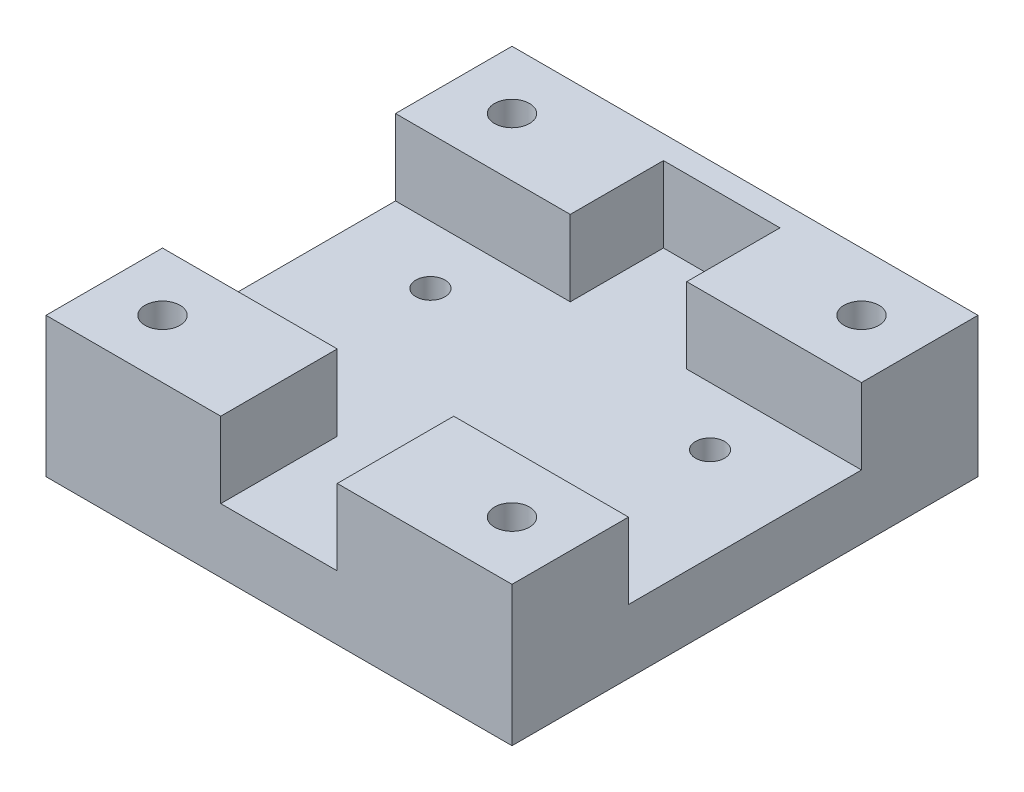
ISO-10303-21;
HEADER;
FILE_DESCRIPTION(('STEP AP214'),'2;1');
FILE_NAME('part.step','',(''),(''),'','','');
FILE_SCHEMA(('AUTOMOTIVE_DESIGN { 1 0 10303 214 1 1 1 1 }'));
ENDSEC;
DATA;
#1=APPLICATION_CONTEXT('core data for automotive mechanical design processes');
#2=APPLICATION_PROTOCOL_DEFINITION('international standard','automotive_design',2000,#1);
#3=PRODUCT_CONTEXT('',#1,'mechanical');
#4=PRODUCT('Part','Part','',(#3));
#5=PRODUCT_RELATED_PRODUCT_CATEGORY('part','',(#4));
#6=PRODUCT_DEFINITION_FORMATION('','',#4);
#7=PRODUCT_DEFINITION_CONTEXT('part definition',#1,'design');
#8=PRODUCT_DEFINITION('design','',#6,#7);
#9=PRODUCT_DEFINITION_SHAPE('','',#8);
#10=(LENGTH_UNIT() NAMED_UNIT(*) SI_UNIT(.MILLI.,.METRE.));
#11=(NAMED_UNIT(*) PLANE_ANGLE_UNIT() SI_UNIT($,.RADIAN.));
#12=(NAMED_UNIT(*) SI_UNIT($,.STERADIAN.) SOLID_ANGLE_UNIT());
#13=UNCERTAINTY_MEASURE_WITH_UNIT(LENGTH_MEASURE(1.E-05),#10,'distance_accuracy_value','');
#14=(GEOMETRIC_REPRESENTATION_CONTEXT(3) GLOBAL_UNCERTAINTY_ASSIGNED_CONTEXT((#13)) GLOBAL_UNIT_ASSIGNED_CONTEXT((#10,
#11,#12)) REPRESENTATION_CONTEXT('',''));
#15=CARTESIAN_POINT('',(0.,0.,0.));
#16=DIRECTION('',(0.,0.,1.));
#17=DIRECTION('',(1.,0.,0.));
#18=AXIS2_PLACEMENT_3D('',#15,#16,#17);
#19=CARTESIAN_POINT('',(5.,0.,40.));
#20=DIRECTION('',(1.,0.,0.));
#21=DIRECTION('',(0.,1.,0.));
#22=AXIS2_PLACEMENT_3D('',#19,#20,#21);
#23=PLANE('',#22);
#24=DIRECTION('',(0.,0.,-1.));
#25=VECTOR('',#24,1.);
#26=CARTESIAN_POINT('',(5.,0.,40.));
#27=LINE('',#26,#25);
#28=CARTESIAN_POINT('',(5.,0.,40.));
#29=VERTEX_POINT('',#28);
#30=CARTESIAN_POINT('',(5.00000000000001,0.,30.));
#31=VERTEX_POINT('',#30);
#32=EDGE_CURVE('E262',#29,#31,#27,.T.);
#33=ORIENTED_EDGE('',*,*,#32,.T.);
#34=DIRECTION('',(0.,1.,0.));
#35=VECTOR('',#34,1.);
#36=CARTESIAN_POINT('',(5.00000000000001,-6.5,30.));
#37=LINE('',#36,#35);
#38=CARTESIAN_POINT('',(5.00000000000001,-6.5,30.));
#39=VERTEX_POINT('',#38);
#40=EDGE_CURVE('E174',#39,#31,#37,.T.);
#41=ORIENTED_EDGE('',*,*,#40,.F.);
#42=DIRECTION('',(0.,0.,-1.));
#43=VECTOR('',#42,1.);
#44=CARTESIAN_POINT('',(5.,-6.5,40.));
#45=LINE('',#44,#43);
#46=CARTESIAN_POINT('',(5.,-6.5,40.));
#47=VERTEX_POINT('',#46);
#48=EDGE_CURVE('E285',#47,#39,#45,.T.);
#49=ORIENTED_EDGE('',*,*,#48,.F.);
#50=DIRECTION('',(0.,-1.,0.));
#51=VECTOR('',#50,1.);
#52=CARTESIAN_POINT('',(5.,0.,40.));
#53=LINE('',#52,#51);
#54=EDGE_CURVE('E234',#29,#47,#53,.T.);
#55=ORIENTED_EDGE('',*,*,#54,.F.);
#56=EDGE_LOOP('',(#33,#41,#49,#55));
#57=FACE_BOUND('',#56,.T.);
#58=ADVANCED_FACE('F33',(#57),#23,.F.);
#59=CARTESIAN_POINT('',(5.,0.,40.));
#60=DIRECTION('',(0.,-1.,0.));
#61=DIRECTION('',(0.,0.,-1.));
#62=AXIS2_PLACEMENT_3D('',#59,#60,#61);
#63=PLANE('',#62);
#64=CARTESIAN_POINT('',(15.,0.,35.));
#65=DIRECTION('',(0.,1.,0.));
#66=DIRECTION('',(-1.,0.,0.));
#67=AXIS2_PLACEMENT_3D('',#64,#65,#66);
#68=CIRCLE('',#67,1.5);
#69=CARTESIAN_POINT('',(13.5,0.,35.));
#70=VERTEX_POINT('',#69);
#71=EDGE_CURVE('E215',#70,#70,#68,.T.);
#72=ORIENTED_EDGE('',*,*,#71,.F.);
#73=EDGE_LOOP('',(#72));
#74=FACE_BOUND('',#73,.T.);
#75=DIRECTION('',(0.,0.,-1.));
#76=VECTOR('',#75,1.);
#77=CARTESIAN_POINT('',(20.,0.,40.));
#78=LINE('',#77,#76);
#79=CARTESIAN_POINT('',(20.,0.,40.));
#80=VERTEX_POINT('',#79);
#81=CARTESIAN_POINT('',(20.,0.,30.));
#82=VERTEX_POINT('',#81);
#83=EDGE_CURVE('E265',#80,#82,#78,.T.);
#84=ORIENTED_EDGE('',*,*,#83,.T.);
#85=DIRECTION('',(1.,0.,0.));
#86=VECTOR('',#85,1.);
#87=CARTESIAN_POINT('',(20.,0.,30.));
#88=LINE('',#87,#86);
#89=EDGE_CURVE('E167',#31,#82,#88,.T.);
#90=ORIENTED_EDGE('',*,*,#89,.F.);
#91=ORIENTED_EDGE('',*,*,#32,.F.);
#92=DIRECTION('',(-1.,0.,0.));
#93=VECTOR('',#92,1.);
#94=CARTESIAN_POINT('',(5.,0.,40.));
#95=LINE('',#94,#93);
#96=EDGE_CURVE('E250',#80,#29,#95,.T.);
#97=ORIENTED_EDGE('',*,*,#96,.F.);
#98=EDGE_LOOP('',(#84,#90,#91,#97));
#99=FACE_BOUND('',#98,.T.);
#100=ADVANCED_FACE('F329',(#74,#99),#63,.F.);
#101=CARTESIAN_POINT('',(12.,-12.001,25.));
#102=DIRECTION('',(0.,1.,0.));
#103=DIRECTION('',(-1.,0.,0.));
#104=AXIS2_PLACEMENT_3D('',#101,#102,#103);
#105=CYLINDRICAL_SURFACE('',#104,1.25);
#106=CARTESIAN_POINT('',(12.,-10.,25.));
#107=DIRECTION('',(0.,1.,0.));
#108=DIRECTION('',(-1.,0.,0.));
#109=AXIS2_PLACEMENT_3D('',#106,#107,#108);
#110=CIRCLE('',#109,1.25);
#111=CARTESIAN_POINT('',(10.75,-10.,25.));
#112=VERTEX_POINT('',#111);
#113=EDGE_CURVE('E41',#112,#112,#110,.F.);
#114=ORIENTED_EDGE('',*,*,#113,.T.);
#115=EDGE_LOOP('',(#114));
#116=FACE_BOUND('',#115,.T.);
#117=CARTESIAN_POINT('',(12.,-6.49999999999999,25.));
#118=DIRECTION('',(0.,1.,0.));
#119=DIRECTION('',(-1.,0.,0.));
#120=AXIS2_PLACEMENT_3D('',#117,#118,#119);
#121=CIRCLE('',#120,1.25);
#122=CARTESIAN_POINT('',(10.75,-6.49999999999999,25.));
#123=VERTEX_POINT('',#122);
#124=EDGE_CURVE('E179',#123,#123,#121,.F.);
#125=ORIENTED_EDGE('',*,*,#124,.F.);
#126=EDGE_LOOP('',(#125));
#127=FACE_BOUND('',#126,.T.);
#128=ADVANCED_FACE('F312',(#116,#127),#105,.F.);
#129=CARTESIAN_POINT('',(12.,-12.001,15.));
#130=DIRECTION('',(0.,1.,0.));
#131=DIRECTION('',(-1.,0.,0.));
#132=AXIS2_PLACEMENT_3D('',#129,#130,#131);
#133=CYLINDRICAL_SURFACE('',#132,1.25);
#134=CARTESIAN_POINT('',(12.,-10.,15.));
#135=DIRECTION('',(0.,1.,0.));
#136=DIRECTION('',(-1.,0.,0.));
#137=AXIS2_PLACEMENT_3D('',#134,#135,#136);
#138=CIRCLE('',#137,1.25);
#139=CARTESIAN_POINT('',(10.75,-10.,15.));
#140=VERTEX_POINT('',#139);
#141=EDGE_CURVE('E287',#140,#140,#138,.F.);
#142=ORIENTED_EDGE('',*,*,#141,.T.);
#143=EDGE_LOOP('',(#142));
#144=FACE_BOUND('',#143,.T.);
#145=CARTESIAN_POINT('',(12.,-6.49999999999999,15.));
#146=DIRECTION('',(0.,1.,0.));
#147=DIRECTION('',(-1.,0.,0.));
#148=AXIS2_PLACEMENT_3D('',#145,#146,#147);
#149=CIRCLE('',#148,1.25);
#150=CARTESIAN_POINT('',(10.75,-6.49999999999999,15.));
#151=VERTEX_POINT('',#150);
#152=EDGE_CURVE('E183',#151,#151,#149,.F.);
#153=ORIENTED_EDGE('',*,*,#152,.F.);
#154=EDGE_LOOP('',(#153));
#155=FACE_BOUND('',#154,.T.);
#156=ADVANCED_FACE('F348',(#144,#155),#133,.F.);
#157=CARTESIAN_POINT('',(-5.,-6.5,40.));
#158=DIRECTION('',(-1.,0.,0.));
#159=DIRECTION('',(0.,0.,1.));
#160=AXIS2_PLACEMENT_3D('',#157,#158,#159);
#161=PLANE('',#160);
#162=DIRECTION('',(0.,0.,-1.));
#163=VECTOR('',#162,1.);
#164=CARTESIAN_POINT('',(-5.,-6.5,40.));
#165=LINE('',#164,#163);
#166=CARTESIAN_POINT('',(-5.,-6.5,10.));
#167=VERTEX_POINT('',#166);
#168=CARTESIAN_POINT('',(-5.,-6.5,2.));
#169=VERTEX_POINT('',#168);
#170=EDGE_CURVE('E280',#167,#169,#165,.T.);
#171=ORIENTED_EDGE('',*,*,#170,.T.);
#172=DIRECTION('',(0.,1.,0.));
#173=VECTOR('',#172,1.);
#174=CARTESIAN_POINT('',(-5.,-6.5,2.));
#175=LINE('',#174,#173);
#176=CARTESIAN_POINT('',(-5.,0.,2.));
#177=VERTEX_POINT('',#176);
#178=EDGE_CURVE('E48',#169,#177,#175,.T.);
#179=ORIENTED_EDGE('',*,*,#178,.T.);
#180=DIRECTION('',(0.,0.,-1.));
#181=VECTOR('',#180,1.);
#182=CARTESIAN_POINT('',(-5.,0.,40.));
#183=LINE('',#182,#181);
#184=CARTESIAN_POINT('',(-5.,0.,10.));
#185=VERTEX_POINT('',#184);
#186=EDGE_CURVE('E276',#185,#177,#183,.T.);
#187=ORIENTED_EDGE('',*,*,#186,.F.);
#188=DIRECTION('',(0.,1.,0.));
#189=VECTOR('',#188,1.);
#190=CARTESIAN_POINT('',(-5.,-6.5,10.));
#191=LINE('',#190,#189);
#192=EDGE_CURVE('E196',#167,#185,#191,.T.);
#193=ORIENTED_EDGE('',*,*,#192,.F.);
#194=EDGE_LOOP('',(#171,#179,#187,#193));
#195=FACE_BOUND('',#194,.T.);
#196=ADVANCED_FACE('F342',(#195),#161,.F.);
#197=CARTESIAN_POINT('',(5.00000000000001,0.,10.));
#198=VERTEX_POINT('',#197);
#199=CARTESIAN_POINT('',(5.,0.,2.));
#200=VERTEX_POINT('',#199);
#201=EDGE_CURVE('E252',#198,#200,#27,.T.);
#202=ORIENTED_EDGE('',*,*,#201,.T.);
#203=DIRECTION('',(0.,-1.,0.));
#204=VECTOR('',#203,1.);
#205=CARTESIAN_POINT('',(5.,0.,2.));
#206=LINE('',#205,#204);
#207=CARTESIAN_POINT('',(5.,-6.5,2.));
#208=VERTEX_POINT('',#207);
#209=EDGE_CURVE('E56',#200,#208,#206,.T.);
#210=ORIENTED_EDGE('',*,*,#209,.T.);
#211=CARTESIAN_POINT('',(5.00000000000001,-6.5,10.));
#212=VERTEX_POINT('',#211);
#213=EDGE_CURVE('E284',#212,#208,#45,.T.);
#214=ORIENTED_EDGE('',*,*,#213,.F.);
#215=DIRECTION('',(0.,1.,0.));
#216=VECTOR('',#215,1.);
#217=CARTESIAN_POINT('',(5.00000000000001,-6.5,10.));
#218=LINE('',#217,#216);
#219=EDGE_CURVE('E155',#212,#198,#218,.T.);
#220=ORIENTED_EDGE('',*,*,#219,.T.);
#221=EDGE_LOOP('',(#202,#210,#214,#220));
#222=FACE_BOUND('',#221,.T.);
#223=ADVANCED_FACE('F332',(#222),#23,.F.);
#224=CARTESIAN_POINT('',(5.,-6.5,40.));
#225=DIRECTION('',(0.,-1.,0.));
#226=DIRECTION('',(1.,0.,0.));
#227=AXIS2_PLACEMENT_3D('',#224,#225,#226);
#228=PLANE('',#227);
#229=ORIENTED_EDGE('',*,*,#213,.T.);
#230=DIRECTION('',(-1.,0.,0.));
#231=VECTOR('',#230,1.);
#232=CARTESIAN_POINT('',(5.,-6.5,2.));
#233=LINE('',#232,#231);
#234=EDGE_CURVE('E358',#208,#169,#233,.T.);
#235=ORIENTED_EDGE('',*,*,#234,.T.);
#236=ORIENTED_EDGE('',*,*,#170,.F.);
#237=DIRECTION('',(-1.,0.,0.));
#238=VECTOR('',#237,1.);
#239=CARTESIAN_POINT('',(-20.,-6.50000000000001,10.));
#240=LINE('',#239,#238);
#241=CARTESIAN_POINT('',(-20.,-6.50000000000001,10.));
#242=VERTEX_POINT('',#241);
#243=EDGE_CURVE('E184',#167,#242,#240,.T.);
#244=ORIENTED_EDGE('',*,*,#243,.T.);
#245=DIRECTION('',(0.,0.,1.));
#246=VECTOR('',#245,1.);
#247=CARTESIAN_POINT('',(-20.,-6.50000000000001,30.));
#248=LINE('',#247,#246);
#249=CARTESIAN_POINT('',(-20.,-6.50000000000001,30.));
#250=VERTEX_POINT('',#249);
#251=EDGE_CURVE('E186',#242,#250,#248,.T.);
#252=ORIENTED_EDGE('',*,*,#251,.T.);
#253=DIRECTION('',(1.,0.,0.));
#254=VECTOR('',#253,1.);
#255=CARTESIAN_POINT('',(-20.,-6.50000000000001,30.));
#256=LINE('',#255,#254);
#257=CARTESIAN_POINT('',(-5.,-6.5,30.));
#258=VERTEX_POINT('',#257);
#259=EDGE_CURVE('E190',#250,#258,#256,.T.);
#260=ORIENTED_EDGE('',*,*,#259,.T.);
#261=CARTESIAN_POINT('',(-5.,-6.5,40.));
#262=VERTEX_POINT('',#261);
#263=EDGE_CURVE('E281',#262,#258,#165,.T.);
#264=ORIENTED_EDGE('',*,*,#263,.F.);
#265=DIRECTION('',(-1.,0.,0.));
#266=VECTOR('',#265,1.);
#267=CARTESIAN_POINT('',(5.,-6.5,40.));
#268=LINE('',#267,#266);
#269=EDGE_CURVE('E237',#47,#262,#268,.T.);
#270=ORIENTED_EDGE('',*,*,#269,.F.);
#271=ORIENTED_EDGE('',*,*,#48,.T.);
#272=DIRECTION('',(1.,0.,0.));
#273=VECTOR('',#272,1.);
#274=CARTESIAN_POINT('',(20.,-6.49999999999999,30.));
#275=LINE('',#274,#273);
#276=CARTESIAN_POINT('',(20.,-6.49999999999999,30.));
#277=VERTEX_POINT('',#276);
#278=EDGE_CURVE('E157',#39,#277,#275,.T.);
#279=ORIENTED_EDGE('',*,*,#278,.T.);
#280=DIRECTION('',(0.,0.,-1.));
#281=VECTOR('',#280,1.);
#282=CARTESIAN_POINT('',(20.,-6.49999999999999,30.));
#283=LINE('',#282,#281);
#284=CARTESIAN_POINT('',(20.,-6.49999999999999,10.));
#285=VERTEX_POINT('',#284);
#286=EDGE_CURVE('E158',#277,#285,#283,.T.);
#287=ORIENTED_EDGE('',*,*,#286,.T.);
#288=DIRECTION('',(-1.,0.,0.));
#289=VECTOR('',#288,1.);
#290=CARTESIAN_POINT('',(20.,-6.49999999999999,10.));
#291=LINE('',#290,#289);
#292=EDGE_CURVE('E148',#285,#212,#291,.T.);
#293=ORIENTED_EDGE('',*,*,#292,.T.);
#294=EDGE_LOOP('',(#229,#235,#236,#244,#252,#260,#264,#270,#271,#279,#287,#293));
#295=FACE_BOUND('',#294,.T.);
#296=CARTESIAN_POINT('',(-12.,-6.50000000000001,15.));
#297=DIRECTION('',(0.,-1.,0.));
#298=DIRECTION('',(1.,0.,0.));
#299=AXIS2_PLACEMENT_3D('',#296,#297,#298);
#300=CIRCLE('',#299,1.25);
#301=CARTESIAN_POINT('',(-10.75,-6.50000000000001,15.));
#302=VERTEX_POINT('',#301);
#303=EDGE_CURVE('E198',#302,#302,#300,.F.);
#304=ORIENTED_EDGE('',*,*,#303,.F.);
#305=EDGE_LOOP('',(#304));
#306=FACE_BOUND('',#305,.T.);
#307=CARTESIAN_POINT('',(-12.,-6.50000000000001,25.));
#308=DIRECTION('',(0.,-1.,0.));
#309=DIRECTION('',(1.,0.,0.));
#310=AXIS2_PLACEMENT_3D('',#307,#308,#309);
#311=CIRCLE('',#310,1.25);
#312=CARTESIAN_POINT('',(-10.75,-6.50000000000001,25.));
#313=VERTEX_POINT('',#312);
#314=EDGE_CURVE('E206',#313,#313,#311,.F.);
#315=ORIENTED_EDGE('',*,*,#314,.F.);
#316=EDGE_LOOP('',(#315));
#317=FACE_BOUND('',#316,.T.);
#318=ORIENTED_EDGE('',*,*,#152,.T.);
#319=EDGE_LOOP('',(#318));
#320=FACE_BOUND('',#319,.T.);
#321=ORIENTED_EDGE('',*,*,#124,.T.);
#322=EDGE_LOOP('',(#321));
#323=FACE_BOUND('',#322,.T.);
#324=ADVANCED_FACE('F162',(#295,#306,#317,#320,#323),#228,.F.);
#325=ORIENTED_EDGE('',*,*,#263,.T.);
#326=DIRECTION('',(0.,1.,0.));
#327=VECTOR('',#326,1.);
#328=CARTESIAN_POINT('',(-5.,-6.5,30.));
#329=LINE('',#328,#327);
#330=CARTESIAN_POINT('',(-5.,0.,30.));
#331=VERTEX_POINT('',#330);
#332=EDGE_CURVE('E199',#258,#331,#329,.T.);
#333=ORIENTED_EDGE('',*,*,#332,.T.);
#334=CARTESIAN_POINT('',(-5.,0.,40.));
#335=VERTEX_POINT('',#334);
#336=EDGE_CURVE('E277',#335,#331,#183,.T.);
#337=ORIENTED_EDGE('',*,*,#336,.F.);
#338=DIRECTION('',(0.,1.,0.));
#339=VECTOR('',#338,1.);
#340=CARTESIAN_POINT('',(-5.,-6.5,40.));
#341=LINE('',#340,#339);
#342=EDGE_CURVE('E240',#262,#335,#341,.T.);
#343=ORIENTED_EDGE('',*,*,#342,.F.);
#344=EDGE_LOOP('',(#325,#333,#337,#343));
#345=FACE_BOUND('',#344,.T.);
#346=ADVANCED_FACE('F347',(#345),#161,.F.);
#347=CARTESIAN_POINT('',(-20.,0.,40.));
#348=DIRECTION('',(0.,-1.,0.));
#349=DIRECTION('',(0.,0.,-1.));
#350=AXIS2_PLACEMENT_3D('',#347,#348,#349);
#351=PLANE('',#350);
#352=CARTESIAN_POINT('',(-15.,0.,35.));
#353=DIRECTION('',(0.,1.,0.));
#354=DIRECTION('',(1.,0.,0.));
#355=AXIS2_PLACEMENT_3D('',#352,#353,#354);
#356=CIRCLE('',#355,1.5);
#357=CARTESIAN_POINT('',(-13.5,0.,35.));
#358=VERTEX_POINT('',#357);
#359=EDGE_CURVE('E221',#358,#358,#356,.T.);
#360=ORIENTED_EDGE('',*,*,#359,.F.);
#361=EDGE_LOOP('',(#360));
#362=FACE_BOUND('',#361,.T.);
#363=ORIENTED_EDGE('',*,*,#336,.T.);
#364=DIRECTION('',(1.,0.,0.));
#365=VECTOR('',#364,1.);
#366=CARTESIAN_POINT('',(-20.,0.,30.));
#367=LINE('',#366,#365);
#368=CARTESIAN_POINT('',(-20.,0.,30.));
#369=VERTEX_POINT('',#368);
#370=EDGE_CURVE('E187',#369,#331,#367,.T.);
#371=ORIENTED_EDGE('',*,*,#370,.F.);
#372=DIRECTION('',(0.,0.,-1.));
#373=VECTOR('',#372,1.);
#374=CARTESIAN_POINT('',(-20.,0.,40.));
#375=LINE('',#374,#373);
#376=CARTESIAN_POINT('',(-20.,0.,40.));
#377=VERTEX_POINT('',#376);
#378=EDGE_CURVE('E273',#377,#369,#375,.T.);
#379=ORIENTED_EDGE('',*,*,#378,.F.);
#380=DIRECTION('',(-1.,0.,0.));
#381=VECTOR('',#380,1.);
#382=CARTESIAN_POINT('',(-20.,0.,40.));
#383=LINE('',#382,#381);
#384=EDGE_CURVE('E242',#335,#377,#383,.T.);
#385=ORIENTED_EDGE('',*,*,#384,.F.);
#386=EDGE_LOOP('',(#363,#371,#379,#385));
#387=FACE_BOUND('',#386,.T.);
#388=ADVANCED_FACE('F410',(#362,#387),#351,.F.);
#389=CARTESIAN_POINT('',(-20.,-12.,40.));
#390=DIRECTION('',(1.,0.,0.));
#391=DIRECTION('',(0.,0.,-1.));
#392=AXIS2_PLACEMENT_3D('',#389,#390,#391);
#393=PLANE('',#392);
#394=CARTESIAN_POINT('',(-20.,0.,10.));
#395=VERTEX_POINT('',#394);
#396=CARTESIAN_POINT('',(-20.,0.,0.));
#397=VERTEX_POINT('',#396);
#398=EDGE_CURVE('E272',#395,#397,#375,.T.);
#399=ORIENTED_EDGE('',*,*,#398,.T.);
#400=DIRECTION('',(0.,-1.,0.));
#401=VECTOR('',#400,1.);
#402=CARTESIAN_POINT('',(-20.,-12.,0.));
#403=LINE('',#402,#401);
#404=CARTESIAN_POINT('',(-20.,-12.,0.));
#405=VERTEX_POINT('',#404);
#406=EDGE_CURVE('E233',#397,#405,#403,.T.);
#407=ORIENTED_EDGE('',*,*,#406,.T.);
#408=DIRECTION('',(0.,0.,-1.));
#409=VECTOR('',#408,1.);
#410=CARTESIAN_POINT('',(-20.,-12.,40.));
#411=LINE('',#410,#409);
#412=CARTESIAN_POINT('',(-20.,-12.,40.));
#413=VERTEX_POINT('',#412);
#414=EDGE_CURVE('E270',#413,#405,#411,.T.);
#415=ORIENTED_EDGE('',*,*,#414,.F.);
#416=DIRECTION('',(0.,-1.,0.));
#417=VECTOR('',#416,1.);
#418=CARTESIAN_POINT('',(-20.,-12.,40.));
#419=LINE('',#418,#417);
#420=EDGE_CURVE('E244',#377,#413,#419,.T.);
#421=ORIENTED_EDGE('',*,*,#420,.F.);
#422=ORIENTED_EDGE('',*,*,#378,.T.);
#423=DIRECTION('',(0.,1.,0.));
#424=VECTOR('',#423,1.);
#425=CARTESIAN_POINT('',(-20.,-6.50000000000001,30.));
#426=LINE('',#425,#424);
#427=EDGE_CURVE('E202',#250,#369,#426,.T.);
#428=ORIENTED_EDGE('',*,*,#427,.F.);
#429=ORIENTED_EDGE('',*,*,#251,.F.);
#430=DIRECTION('',(0.,1.,0.));
#431=VECTOR('',#430,1.);
#432=CARTESIAN_POINT('',(-20.,-6.50000000000001,10.));
#433=LINE('',#432,#431);
#434=EDGE_CURVE('E193',#242,#395,#433,.T.);
#435=ORIENTED_EDGE('',*,*,#434,.T.);
#436=EDGE_LOOP('',(#399,#407,#415,#421,#422,#428,#429,#435));
#437=FACE_BOUND('',#436,.T.);
#438=ADVANCED_FACE('F396',(#437),#393,.F.);
#439=CARTESIAN_POINT('',(20.,-12.,40.));
#440=DIRECTION('',(0.,1.,0.));
#441=DIRECTION('',(-1.,0.,0.));
#442=AXIS2_PLACEMENT_3D('',#439,#440,#441);
#443=PLANE('',#442);
#444=CARTESIAN_POINT('',(12.,-12.,15.));
#445=DIRECTION('',(0.,1.,0.));
#446=DIRECTION('',(-1.,0.,0.));
#447=AXIS2_PLACEMENT_3D('',#444,#445,#446);
#448=CIRCLE('',#447,3.25000000000001);
#449=CARTESIAN_POINT('',(8.75,-12.,15.));
#450=VERTEX_POINT('',#449);
#451=EDGE_CURVE('E304',#450,#450,#448,.T.);
#452=ORIENTED_EDGE('',*,*,#451,.T.);
#453=EDGE_LOOP('',(#452));
#454=FACE_BOUND('',#453,.T.);
#455=CARTESIAN_POINT('',(-12.,-12.,15.));
#456=DIRECTION('',(0.,1.,0.));
#457=DIRECTION('',(-1.,0.,0.));
#458=AXIS2_PLACEMENT_3D('',#455,#456,#457);
#459=CIRCLE('',#458,3.25000000000001);
#460=CARTESIAN_POINT('',(-15.25,-12.,15.));
#461=VERTEX_POINT('',#460);
#462=EDGE_CURVE('E301',#461,#461,#459,.T.);
#463=ORIENTED_EDGE('',*,*,#462,.T.);
#464=EDGE_LOOP('',(#463));
#465=FACE_BOUND('',#464,.T.);
#466=CARTESIAN_POINT('',(12.,-12.,25.));
#467=DIRECTION('',(0.,1.,0.));
#468=DIRECTION('',(-1.,0.,0.));
#469=AXIS2_PLACEMENT_3D('',#466,#467,#468);
#470=CIRCLE('',#469,3.25000000000001);
#471=CARTESIAN_POINT('',(8.75,-12.,25.));
#472=VERTEX_POINT('',#471);
#473=EDGE_CURVE('E298',#472,#472,#470,.T.);
#474=ORIENTED_EDGE('',*,*,#473,.T.);
#475=EDGE_LOOP('',(#474));
#476=FACE_BOUND('',#475,.T.);
#477=CARTESIAN_POINT('',(-12.,-12.,25.));
#478=DIRECTION('',(0.,1.,0.));
#479=DIRECTION('',(-1.,0.,0.));
#480=AXIS2_PLACEMENT_3D('',#477,#478,#479);
#481=CIRCLE('',#480,3.25000000000001);
#482=CARTESIAN_POINT('',(-15.25,-12.,25.));
#483=VERTEX_POINT('',#482);
#484=EDGE_CURVE('E295',#483,#483,#481,.T.);
#485=ORIENTED_EDGE('',*,*,#484,.T.);
#486=EDGE_LOOP('',(#485));
#487=FACE_BOUND('',#486,.T.);
#488=CARTESIAN_POINT('',(15.,-12.,5.));
#489=DIRECTION('',(0.,1.,0.));
#490=DIRECTION('',(-1.,0.,0.));
#491=AXIS2_PLACEMENT_3D('',#488,#489,#490);
#492=CIRCLE('',#491,1.5);
#493=CARTESIAN_POINT('',(13.5,-12.,5.));
#494=VERTEX_POINT('',#493);
#495=EDGE_CURVE('E212',#494,#494,#492,.F.);
#496=ORIENTED_EDGE('',*,*,#495,.F.);
#497=EDGE_LOOP('',(#496));
#498=FACE_BOUND('',#497,.T.);
#499=CARTESIAN_POINT('',(15.,-12.,35.));
#500=DIRECTION('',(0.,1.,0.));
#501=DIRECTION('',(-1.,0.,0.));
#502=AXIS2_PLACEMENT_3D('',#499,#500,#501);
#503=CIRCLE('',#502,1.5);
#504=CARTESIAN_POINT('',(13.5,-12.,35.));
#505=VERTEX_POINT('',#504);
#506=EDGE_CURVE('E218',#505,#505,#503,.F.);
#507=ORIENTED_EDGE('',*,*,#506,.F.);
#508=EDGE_LOOP('',(#507));
#509=FACE_BOUND('',#508,.T.);
#510=CARTESIAN_POINT('',(-15.,-12.,35.));
#511=DIRECTION('',(0.,1.,0.));
#512=DIRECTION('',(-1.,0.,0.));
#513=AXIS2_PLACEMENT_3D('',#510,#511,#512);
#514=CIRCLE('',#513,1.5);
#515=CARTESIAN_POINT('',(-16.5,-12.,35.));
#516=VERTEX_POINT('',#515);
#517=EDGE_CURVE('E224',#516,#516,#514,.F.);
#518=ORIENTED_EDGE('',*,*,#517,.F.);
#519=EDGE_LOOP('',(#518));
#520=FACE_BOUND('',#519,.T.);
#521=CARTESIAN_POINT('',(-15.,-12.,5.));
#522=DIRECTION('',(0.,1.,0.));
#523=DIRECTION('',(-1.,0.,0.));
#524=AXIS2_PLACEMENT_3D('',#521,#522,#523);
#525=CIRCLE('',#524,1.5);
#526=CARTESIAN_POINT('',(-16.5,-12.,5.));
#527=VERTEX_POINT('',#526);
#528=EDGE_CURVE('E230',#527,#527,#525,.F.);
#529=ORIENTED_EDGE('',*,*,#528,.F.);
#530=EDGE_LOOP('',(#529));
#531=FACE_BOUND('',#530,.T.);
#532=ORIENTED_EDGE('',*,*,#414,.T.);
#533=DIRECTION('',(1.,0.,0.));
#534=VECTOR('',#533,1.);
#535=CARTESIAN_POINT('',(20.,-12.,0.));
#536=LINE('',#535,#534);
#537=CARTESIAN_POINT('',(20.,-12.,0.));
#538=VERTEX_POINT('',#537);
#539=EDGE_CURVE('E255',#405,#538,#536,.T.);
#540=ORIENTED_EDGE('',*,*,#539,.T.);
#541=DIRECTION('',(0.,0.,-1.));
#542=VECTOR('',#541,1.);
#543=CARTESIAN_POINT('',(20.,-12.,40.));
#544=LINE('',#543,#542);
#545=CARTESIAN_POINT('',(20.,-12.,40.));
#546=VERTEX_POINT('',#545);
#547=EDGE_CURVE('E268',#546,#538,#544,.T.);
#548=ORIENTED_EDGE('',*,*,#547,.F.);
#549=DIRECTION('',(1.,0.,0.));
#550=VECTOR('',#549,1.);
#551=CARTESIAN_POINT('',(20.,-12.,40.));
#552=LINE('',#551,#550);
#553=EDGE_CURVE('E246',#413,#546,#552,.T.);
#554=ORIENTED_EDGE('',*,*,#553,.F.);
#555=EDGE_LOOP('',(#532,#540,#548,#554));
#556=FACE_BOUND('',#555,.T.);
#557=ADVANCED_FACE('F389',(#454,#465,#476,#487,#498,#509,#520,#531,#556),#443,.F.);
#558=CARTESIAN_POINT('',(20.,0.,40.));
#559=DIRECTION('',(-1.,0.,0.));
#560=DIRECTION('',(0.,0.,1.));
#561=AXIS2_PLACEMENT_3D('',#558,#559,#560);
#562=PLANE('',#561);
#563=ORIENTED_EDGE('',*,*,#547,.T.);
#564=DIRECTION('',(0.,1.,0.));
#565=VECTOR('',#564,1.);
#566=CARTESIAN_POINT('',(20.,0.,0.));
#567=LINE('',#566,#565);
#568=CARTESIAN_POINT('',(20.,0.,0.));
#569=VERTEX_POINT('',#568);
#570=EDGE_CURVE('E258',#538,#569,#567,.T.);
#571=ORIENTED_EDGE('',*,*,#570,.T.);
#572=CARTESIAN_POINT('',(20.,0.,10.));
#573=VERTEX_POINT('',#572);
#574=EDGE_CURVE('E172',#573,#569,#78,.T.);
#575=ORIENTED_EDGE('',*,*,#574,.F.);
#576=DIRECTION('',(0.,1.,0.));
#577=VECTOR('',#576,1.);
#578=CARTESIAN_POINT('',(20.,-6.49999999999999,10.));
#579=LINE('',#578,#577);
#580=EDGE_CURVE('E152',#285,#573,#579,.T.);
#581=ORIENTED_EDGE('',*,*,#580,.F.);
#582=ORIENTED_EDGE('',*,*,#286,.F.);
#583=DIRECTION('',(0.,1.,0.));
#584=VECTOR('',#583,1.);
#585=CARTESIAN_POINT('',(20.,-6.49999999999999,30.));
#586=LINE('',#585,#584);
#587=EDGE_CURVE('E292',#277,#82,#586,.T.);
#588=ORIENTED_EDGE('',*,*,#587,.T.);
#589=ORIENTED_EDGE('',*,*,#83,.F.);
#590=DIRECTION('',(0.,1.,0.));
#591=VECTOR('',#590,1.);
#592=CARTESIAN_POINT('',(20.,0.,40.));
#593=LINE('',#592,#591);
#594=EDGE_CURVE('E248',#546,#80,#593,.T.);
#595=ORIENTED_EDGE('',*,*,#594,.F.);
#596=EDGE_LOOP('',(#563,#571,#575,#581,#582,#588,#589,#595));
#597=FACE_BOUND('',#596,.T.);
#598=ADVANCED_FACE('F170',(#597),#562,.F.);
#599=CARTESIAN_POINT('',(15.,0.,5.));
#600=DIRECTION('',(0.,1.,0.));
#601=DIRECTION('',(1.,0.,0.));
#602=AXIS2_PLACEMENT_3D('',#599,#600,#601);
#603=CIRCLE('',#602,1.5);
#604=CARTESIAN_POINT('',(16.5,0.,5.));
#605=VERTEX_POINT('',#604);
#606=EDGE_CURVE('E209',#605,#605,#603,.T.);
#607=ORIENTED_EDGE('',*,*,#606,.F.);
#608=EDGE_LOOP('',(#607));
#609=FACE_BOUND('',#608,.T.);
#610=ORIENTED_EDGE('',*,*,#574,.T.);
#611=DIRECTION('',(-1.,0.,0.));
#612=VECTOR('',#611,1.);
#613=CARTESIAN_POINT('',(5.,0.,0.));
#614=LINE('',#613,#612);
#615=EDGE_CURVE('E238',#569,#397,#614,.T.);
#616=ORIENTED_EDGE('',*,*,#615,.T.);
#617=ORIENTED_EDGE('',*,*,#398,.F.);
#618=DIRECTION('',(-1.,0.,0.));
#619=VECTOR('',#618,1.);
#620=CARTESIAN_POINT('',(-20.,0.,10.));
#621=LINE('',#620,#619);
#622=EDGE_CURVE('E182',#185,#395,#621,.T.);
#623=ORIENTED_EDGE('',*,*,#622,.F.);
#624=ORIENTED_EDGE('',*,*,#186,.T.);
#625=DIRECTION('',(1.,0.,0.));
#626=VECTOR('',#625,1.);
#627=CARTESIAN_POINT('',(20.,0.,2.));
#628=LINE('',#627,#626);
#629=EDGE_CURVE('E357',#177,#200,#628,.T.);
#630=ORIENTED_EDGE('',*,*,#629,.T.);
#631=ORIENTED_EDGE('',*,*,#201,.F.);
#632=DIRECTION('',(-1.,0.,0.));
#633=VECTOR('',#632,1.);
#634=CARTESIAN_POINT('',(20.,0.,10.));
#635=LINE('',#634,#633);
#636=EDGE_CURVE('E365',#573,#198,#635,.T.);
#637=ORIENTED_EDGE('',*,*,#636,.F.);
#638=EDGE_LOOP('',(#610,#616,#617,#623,#624,#630,#631,#637));
#639=FACE_BOUND('',#638,.T.);
#640=CARTESIAN_POINT('',(-15.,0.,5.));
#641=DIRECTION('',(0.,1.,0.));
#642=DIRECTION('',(-1.,0.,0.));
#643=AXIS2_PLACEMENT_3D('',#640,#641,#642);
#644=CIRCLE('',#643,1.5);
#645=CARTESIAN_POINT('',(-16.5,0.,5.));
#646=VERTEX_POINT('',#645);
#647=EDGE_CURVE('E227',#646,#646,#644,.T.);
#648=ORIENTED_EDGE('',*,*,#647,.F.);
#649=EDGE_LOOP('',(#648));
#650=FACE_BOUND('',#649,.T.);
#651=ADVANCED_FACE('F338',(#609,#639,#650),#63,.F.);
#652=CARTESIAN_POINT('',(5.,-6.5,40.));
#653=DIRECTION('',(0.,0.,-1.));
#654=DIRECTION('',(-1.,0.,0.));
#655=AXIS2_PLACEMENT_3D('',#652,#653,#654);
#656=PLANE('',#655);
#657=ORIENTED_EDGE('',*,*,#54,.T.);
#658=ORIENTED_EDGE('',*,*,#269,.T.);
#659=ORIENTED_EDGE('',*,*,#342,.T.);
#660=ORIENTED_EDGE('',*,*,#384,.T.);
#661=ORIENTED_EDGE('',*,*,#420,.T.);
#662=ORIENTED_EDGE('',*,*,#553,.T.);
#663=ORIENTED_EDGE('',*,*,#594,.T.);
#664=ORIENTED_EDGE('',*,*,#96,.T.);
#665=EDGE_LOOP('',(#657,#658,#659,#660,#661,#662,#663,#664));
#666=FACE_BOUND('',#665,.T.);
#667=ADVANCED_FACE('F380',(#666),#656,.F.);
#668=CARTESIAN_POINT('',(5.,-6.5,0.));
#669=DIRECTION('',(0.,0.,-1.));
#670=DIRECTION('',(-1.,0.,0.));
#671=AXIS2_PLACEMENT_3D('',#668,#669,#670);
#672=PLANE('',#671);
#673=ORIENTED_EDGE('',*,*,#406,.F.);
#674=ORIENTED_EDGE('',*,*,#615,.F.);
#675=ORIENTED_EDGE('',*,*,#570,.F.);
#676=ORIENTED_EDGE('',*,*,#539,.F.);
#677=EDGE_LOOP('',(#673,#674,#675,#676));
#678=FACE_BOUND('',#677,.T.);
#679=ADVANCED_FACE('F393',(#678),#672,.T.);
#680=CARTESIAN_POINT('',(-15.,-12.001,5.));
#681=DIRECTION('',(0.,1.,0.));
#682=DIRECTION('',(-1.,0.,0.));
#683=AXIS2_PLACEMENT_3D('',#680,#681,#682);
#684=CYLINDRICAL_SURFACE('',#683,1.5);
#685=ORIENTED_EDGE('',*,*,#647,.T.);
#686=EDGE_LOOP('',(#685));
#687=FACE_BOUND('',#686,.T.);
#688=ORIENTED_EDGE('',*,*,#528,.T.);
#689=EDGE_LOOP('',(#688));
#690=FACE_BOUND('',#689,.T.);
#691=ADVANCED_FACE('F433',(#687,#690),#684,.F.);
#692=CARTESIAN_POINT('',(-15.,-12.001,35.));
#693=DIRECTION('',(0.,1.,0.));
#694=DIRECTION('',(-1.,0.,0.));
#695=AXIS2_PLACEMENT_3D('',#692,#693,#694);
#696=CYLINDRICAL_SURFACE('',#695,1.5);
#697=ORIENTED_EDGE('',*,*,#359,.T.);
#698=EDGE_LOOP('',(#697));
#699=FACE_BOUND('',#698,.T.);
#700=ORIENTED_EDGE('',*,*,#517,.T.);
#701=EDGE_LOOP('',(#700));
#702=FACE_BOUND('',#701,.T.);
#703=ADVANCED_FACE('F438',(#699,#702),#696,.F.);
#704=CARTESIAN_POINT('',(15.,-12.001,35.));
#705=DIRECTION('',(0.,1.,0.));
#706=DIRECTION('',(-1.,0.,0.));
#707=AXIS2_PLACEMENT_3D('',#704,#705,#706);
#708=CYLINDRICAL_SURFACE('',#707,1.5);
#709=ORIENTED_EDGE('',*,*,#71,.T.);
#710=EDGE_LOOP('',(#709));
#711=FACE_BOUND('',#710,.T.);
#712=ORIENTED_EDGE('',*,*,#506,.T.);
#713=EDGE_LOOP('',(#712));
#714=FACE_BOUND('',#713,.T.);
#715=ADVANCED_FACE('F442',(#711,#714),#708,.F.);
#716=CARTESIAN_POINT('',(15.,-12.001,5.));
#717=DIRECTION('',(0.,1.,0.));
#718=DIRECTION('',(-1.,0.,0.));
#719=AXIS2_PLACEMENT_3D('',#716,#717,#718);
#720=CYLINDRICAL_SURFACE('',#719,1.5);
#721=ORIENTED_EDGE('',*,*,#606,.T.);
#722=EDGE_LOOP('',(#721));
#723=FACE_BOUND('',#722,.T.);
#724=ORIENTED_EDGE('',*,*,#495,.T.);
#725=EDGE_LOOP('',(#724));
#726=FACE_BOUND('',#725,.T.);
#727=ADVANCED_FACE('F446',(#723,#726),#720,.F.);
#728=CARTESIAN_POINT('',(-12.,-12.001,25.));
#729=DIRECTION('',(0.,1.,0.));
#730=DIRECTION('',(-1.,0.,0.));
#731=AXIS2_PLACEMENT_3D('',#728,#729,#730);
#732=CYLINDRICAL_SURFACE('',#731,1.25);
#733=CARTESIAN_POINT('',(-12.,-10.,25.));
#734=DIRECTION('',(0.,1.,0.));
#735=DIRECTION('',(-1.,0.,0.));
#736=AXIS2_PLACEMENT_3D('',#733,#734,#735);
#737=CIRCLE('',#736,1.25);
#738=CARTESIAN_POINT('',(-13.25,-10.,25.));
#739=VERTEX_POINT('',#738);
#740=EDGE_CURVE('E11',#739,#739,#737,.F.);
#741=ORIENTED_EDGE('',*,*,#740,.T.);
#742=EDGE_LOOP('',(#741));
#743=FACE_BOUND('',#742,.T.);
#744=ORIENTED_EDGE('',*,*,#314,.T.);
#745=EDGE_LOOP('',(#744));
#746=FACE_BOUND('',#745,.T.);
#747=ADVANCED_FACE('F450',(#743,#746),#732,.F.);
#748=CARTESIAN_POINT('',(-12.,-12.001,15.));
#749=DIRECTION('',(0.,1.,0.));
#750=DIRECTION('',(-1.,0.,0.));
#751=AXIS2_PLACEMENT_3D('',#748,#749,#750);
#752=CYLINDRICAL_SURFACE('',#751,1.25);
#753=CARTESIAN_POINT('',(-12.,-10.,15.));
#754=DIRECTION('',(0.,1.,0.));
#755=DIRECTION('',(-1.,0.,0.));
#756=AXIS2_PLACEMENT_3D('',#753,#754,#755);
#757=CIRCLE('',#756,1.25);
#758=CARTESIAN_POINT('',(-13.25,-10.,15.));
#759=VERTEX_POINT('',#758);
#760=EDGE_CURVE('E307',#759,#759,#757,.F.);
#761=ORIENTED_EDGE('',*,*,#760,.T.);
#762=EDGE_LOOP('',(#761));
#763=FACE_BOUND('',#762,.T.);
#764=ORIENTED_EDGE('',*,*,#303,.T.);
#765=EDGE_LOOP('',(#764));
#766=FACE_BOUND('',#765,.T.);
#767=ADVANCED_FACE('F454',(#763,#766),#752,.F.);
#768=CARTESIAN_POINT('',(-20.,-6.50000000000001,10.));
#769=DIRECTION('',(0.,0.,-1.));
#770=DIRECTION('',(-1.,0.,0.));
#771=AXIS2_PLACEMENT_3D('',#768,#769,#770);
#772=PLANE('',#771);
#773=ORIENTED_EDGE('',*,*,#622,.T.);
#774=ORIENTED_EDGE('',*,*,#434,.F.);
#775=ORIENTED_EDGE('',*,*,#243,.F.);
#776=ORIENTED_EDGE('',*,*,#192,.T.);
#777=EDGE_LOOP('',(#773,#774,#775,#776));
#778=FACE_BOUND('',#777,.T.);
#779=ADVANCED_FACE('F401',(#778),#772,.F.);
#780=CARTESIAN_POINT('',(-20.,-6.50000000000001,30.));
#781=DIRECTION('',(0.,0.,1.));
#782=DIRECTION('',(1.,0.,0.));
#783=AXIS2_PLACEMENT_3D('',#780,#781,#782);
#784=PLANE('',#783);
#785=ORIENTED_EDGE('',*,*,#370,.T.);
#786=ORIENTED_EDGE('',*,*,#332,.F.);
#787=ORIENTED_EDGE('',*,*,#259,.F.);
#788=ORIENTED_EDGE('',*,*,#427,.T.);
#789=EDGE_LOOP('',(#785,#786,#787,#788));
#790=FACE_BOUND('',#789,.T.);
#791=ADVANCED_FACE('F408',(#790),#784,.F.);
#792=CARTESIAN_POINT('',(20.,-6.49999999999999,30.));
#793=DIRECTION('',(0.,0.,1.));
#794=DIRECTION('',(1.,0.,0.));
#795=AXIS2_PLACEMENT_3D('',#792,#793,#794);
#796=PLANE('',#795);
#797=ORIENTED_EDGE('',*,*,#89,.T.);
#798=ORIENTED_EDGE('',*,*,#587,.F.);
#799=ORIENTED_EDGE('',*,*,#278,.F.);
#800=ORIENTED_EDGE('',*,*,#40,.T.);
#801=EDGE_LOOP('',(#797,#798,#799,#800));
#802=FACE_BOUND('',#801,.T.);
#803=ADVANCED_FACE('F372',(#802),#796,.F.);
#804=CARTESIAN_POINT('',(20.,-6.49999999999999,10.));
#805=DIRECTION('',(0.,0.,-1.));
#806=DIRECTION('',(-1.,0.,0.));
#807=AXIS2_PLACEMENT_3D('',#804,#805,#806);
#808=PLANE('',#807);
#809=ORIENTED_EDGE('',*,*,#636,.T.);
#810=ORIENTED_EDGE('',*,*,#219,.F.);
#811=ORIENTED_EDGE('',*,*,#292,.F.);
#812=ORIENTED_EDGE('',*,*,#580,.T.);
#813=EDGE_LOOP('',(#809,#810,#811,#812));
#814=FACE_BOUND('',#813,.T.);
#815=ADVANCED_FACE('F150',(#814),#808,.F.);
#816=CARTESIAN_POINT('',(20.,0.,2.));
#817=DIRECTION('',(0.,0.,1.));
#818=DIRECTION('',(1.,0.,0.));
#819=AXIS2_PLACEMENT_3D('',#816,#817,#818);
#820=PLANE('',#819);
#821=ORIENTED_EDGE('',*,*,#178,.F.);
#822=ORIENTED_EDGE('',*,*,#234,.F.);
#823=ORIENTED_EDGE('',*,*,#209,.F.);
#824=ORIENTED_EDGE('',*,*,#629,.F.);
#825=EDGE_LOOP('',(#821,#822,#823,#824));
#826=FACE_BOUND('',#825,.T.);
#827=ADVANCED_FACE('F356',(#826),#820,.T.);
#828=CARTESIAN_POINT('',(12.,-10.,15.));
#829=DIRECTION('',(0.,-1.,0.));
#830=DIRECTION('',(1.,0.,0.));
#831=AXIS2_PLACEMENT_3D('',#828,#829,#830);
#832=CONICAL_SURFACE('',#831,1.25,0.78539816339745);
#833=ORIENTED_EDGE('',*,*,#451,.F.);
#834=EDGE_LOOP('',(#833));
#835=FACE_BOUND('',#834,.T.);
#836=ORIENTED_EDGE('',*,*,#141,.F.);
#837=EDGE_LOOP('',(#836));
#838=FACE_BOUND('',#837,.T.);
#839=ADVANCED_FACE('F324',(#835,#838),#832,.F.);
#840=CARTESIAN_POINT('',(-12.,-10.,15.));
#841=DIRECTION('',(0.,-1.,0.));
#842=DIRECTION('',(1.,0.,0.));
#843=AXIS2_PLACEMENT_3D('',#840,#841,#842);
#844=CONICAL_SURFACE('',#843,1.25,0.785398163397451);
#845=ORIENTED_EDGE('',*,*,#462,.F.);
#846=EDGE_LOOP('',(#845));
#847=FACE_BOUND('',#846,.T.);
#848=ORIENTED_EDGE('',*,*,#760,.F.);
#849=EDGE_LOOP('',(#848));
#850=FACE_BOUND('',#849,.T.);
#851=ADVANCED_FACE('F317',(#847,#850),#844,.F.);
#852=CARTESIAN_POINT('',(12.,-10.,25.));
#853=DIRECTION('',(0.,-1.,0.));
#854=DIRECTION('',(1.,0.,0.));
#855=AXIS2_PLACEMENT_3D('',#852,#853,#854);
#856=CONICAL_SURFACE('',#855,1.25,0.78539816339745);
#857=ORIENTED_EDGE('',*,*,#473,.F.);
#858=EDGE_LOOP('',(#857));
#859=FACE_BOUND('',#858,.T.);
#860=ORIENTED_EDGE('',*,*,#113,.F.);
#861=EDGE_LOOP('',(#860));
#862=FACE_BOUND('',#861,.T.);
#863=ADVANCED_FACE('F315',(#859,#862),#856,.F.);
#864=CARTESIAN_POINT('',(-12.,-10.,25.));
#865=DIRECTION('',(0.,-1.,0.));
#866=DIRECTION('',(1.,0.,0.));
#867=AXIS2_PLACEMENT_3D('',#864,#865,#866);
#868=CONICAL_SURFACE('',#867,1.25,0.785398163397451);
#869=ORIENTED_EDGE('',*,*,#484,.F.);
#870=EDGE_LOOP('',(#869));
#871=FACE_BOUND('',#870,.T.);
#872=ORIENTED_EDGE('',*,*,#740,.F.);
#873=EDGE_LOOP('',(#872));
#874=FACE_BOUND('',#873,.T.);
#875=ADVANCED_FACE('F35',(#871,#874),#868,.F.);
#876=CLOSED_SHELL('',(#58,#100,#128,#156,#196,#223,#324,#346,#388,#438,#557,#598,#651,#667,#679,
#691,#703,#715,#727,#747,#767,#779,#791,#803,#815,#827,#839,#851,#863,#875));
#877=MANIFOLD_SOLID_BREP('B2',#876);
#878=ADVANCED_BREP_SHAPE_REPRESENTATION('',(#18,#877),#14);
#879=SHAPE_DEFINITION_REPRESENTATION(#9,#878);
ENDSEC;
END-ISO-10303-21;
